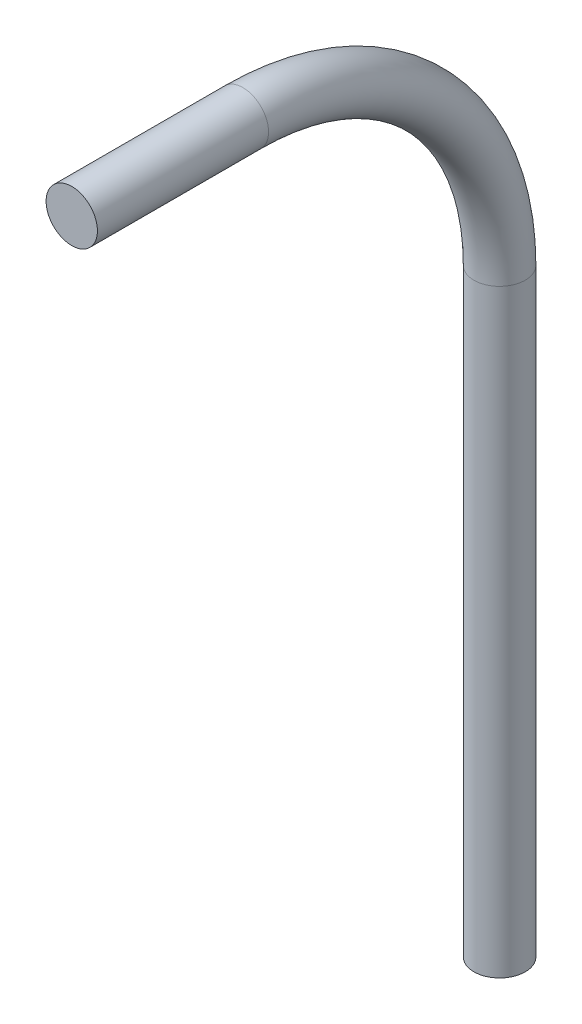
ISO-10303-21;
HEADER;
FILE_DESCRIPTION(('STEP AP214'),'2;1');
FILE_NAME('part.step','',(''),(''),'','','');
FILE_SCHEMA(('AUTOMOTIVE_DESIGN { 1 0 10303 214 1 1 1 1 }'));
ENDSEC;
DATA;
#1=APPLICATION_CONTEXT('core data for automotive mechanical design processes');
#2=APPLICATION_PROTOCOL_DEFINITION('international standard','automotive_design',2000,#1);
#3=PRODUCT_CONTEXT('',#1,'mechanical');
#4=PRODUCT('Part','Part','',(#3));
#5=PRODUCT_RELATED_PRODUCT_CATEGORY('part','',(#4));
#6=PRODUCT_DEFINITION_FORMATION('','',#4);
#7=PRODUCT_DEFINITION_CONTEXT('part definition',#1,'design');
#8=PRODUCT_DEFINITION('design','',#6,#7);
#9=PRODUCT_DEFINITION_SHAPE('','',#8);
#10=(LENGTH_UNIT() NAMED_UNIT(*) SI_UNIT(.MILLI.,.METRE.));
#11=(NAMED_UNIT(*) PLANE_ANGLE_UNIT() SI_UNIT($,.RADIAN.));
#12=(NAMED_UNIT(*) SI_UNIT($,.STERADIAN.) SOLID_ANGLE_UNIT());
#13=UNCERTAINTY_MEASURE_WITH_UNIT(LENGTH_MEASURE(1.E-05),#10,'distance_accuracy_value','');
#14=(GEOMETRIC_REPRESENTATION_CONTEXT(3) GLOBAL_UNCERTAINTY_ASSIGNED_CONTEXT((#13)) GLOBAL_UNIT_ASSIGNED_CONTEXT((#10,
#11,#12)) REPRESENTATION_CONTEXT('',''));
#15=CARTESIAN_POINT('',(0.,0.,0.));
#16=DIRECTION('',(0.,0.,1.));
#17=DIRECTION('',(1.,0.,0.));
#18=AXIS2_PLACEMENT_3D('',#15,#16,#17);
#19=CARTESIAN_POINT('',(-4.44089209850063E-13,-30.0000000000005,-49.9999999999999));
#20=DIRECTION('',(0.,-0.999999999999999,0.));
#21=DIRECTION('',(0.,0.,-0.999999999999999));
#22=AXIS2_PLACEMENT_3D('',#19,#20,#21);
#23=CYLINDRICAL_SURFACE('',#22,3.);
#24=CARTESIAN_POINT('',(-4.44089209850063E-13,-30.0000000000005,-49.9999999999999));
#25=DIRECTION('',(0.,0.999999999999999,0.));
#26=DIRECTION('',(1.,0.,0.));
#27=AXIS2_PLACEMENT_3D('',#24,#25,#26);
#28=CIRCLE('',#27,3.);
#29=CARTESIAN_POINT('',(-4.2188474935756E-13,-30.0000000000005,-52.9999999999999));
#30=VERTEX_POINT('',#29);
#31=EDGE_CURVE('E43',#30,#30,#28,.T.);
#32=ORIENTED_EDGE('',*,*,#31,.F.);
#33=EDGE_LOOP('',(#32));
#34=FACE_BOUND('',#33,.T.);
#35=CARTESIAN_POINT('',(-6.66133814775094E-13,-100.000000000001,-49.9999999999997));
#36=DIRECTION('',(0.,0.999999999999999,0.));
#37=DIRECTION('',(1.,0.,0.));
#38=AXIS2_PLACEMENT_3D('',#35,#36,#37);
#39=CIRCLE('',#38,3.);
#40=CARTESIAN_POINT('',(2.99999999999933,-100.000000000001,-49.9999999999997));
#41=VERTEX_POINT('',#40);
#42=EDGE_CURVE('E10',#41,#41,#39,.T.);
#43=ORIENTED_EDGE('',*,*,#42,.T.);
#44=EDGE_LOOP('',(#43));
#45=FACE_BOUND('',#44,.T.);
#46=ADVANCED_FACE('F37',(#34,#45),#23,.T.);
#47=CARTESIAN_POINT('',(-6.66133814775094E-13,-30.0000000000007,-19.9999999999999));
#48=DIRECTION('',(-1.,0.,0.));
#49=DIRECTION('',(0.,0.,0.999999999999999));
#50=AXIS2_PLACEMENT_3D('',#47,#48,#49);
#51=TOROIDAL_SURFACE('',#50,30.,3.);
#52=CARTESIAN_POINT('',(-1.11022302462516E-13,-4.44089209850063E-13,-19.9999999999999));
#53=DIRECTION('',(0.,0.,0.999999999999999));
#54=DIRECTION('',(1.,0.,0.));
#55=AXIS2_PLACEMENT_3D('',#52,#53,#54);
#56=CIRCLE('',#55,3.);
#57=CARTESIAN_POINT('',(0.,2.99999999999931,-19.9999999999999));
#58=VERTEX_POINT('',#57);
#59=EDGE_CURVE('E47',#58,#58,#56,.T.);
#60=CARTESIAN_POINT('',(-6.66133814775094E-13,-30.0000000000007,-19.9999999999999));
#61=DIRECTION('',(-1.,0.,0.));
#62=DIRECTION('',(0.,0.,0.999999999999999));
#63=AXIS2_PLACEMENT_3D('',#60,#61,#62);
#64=CIRCLE('',#63,33.);
#65=EDGE_CURVE('',#58,#30,#64,.T.);
#66=ORIENTED_EDGE('',*,*,#59,.F.);
#67=ORIENTED_EDGE('',*,*,#31,.T.);
#68=ORIENTED_EDGE('',*,*,#65,.T.);
#69=ORIENTED_EDGE('',*,*,#65,.F.);
#70=EDGE_LOOP('',(#66,#68,#67,#69));
#71=FACE_BOUND('',#70,.T.);
#72=ADVANCED_FACE('F62',(#71),#51,.T.);
#73=CARTESIAN_POINT('',(-1.11022302462516E-13,-4.44089209850063E-13,-19.9999999999999));
#74=DIRECTION('',(0.,0.,0.999999999999999));
#75=DIRECTION('',(1.,0.,0.));
#76=AXIS2_PLACEMENT_3D('',#73,#74,#75);
#77=CYLINDRICAL_SURFACE('',#76,3.);
#78=ORIENTED_EDGE('',*,*,#59,.T.);
#79=EDGE_LOOP('',(#78));
#80=FACE_BOUND('',#79,.T.);
#81=CARTESIAN_POINT('',(-3.33066907387547E-13,-4.44089209850063E-13,0.));
#82=DIRECTION('',(0.,0.,0.999999999999999));
#83=DIRECTION('',(1.,0.,0.));
#84=AXIS2_PLACEMENT_3D('',#81,#82,#83);
#85=CIRCLE('',#84,3.);
#86=CARTESIAN_POINT('',(2.99999999999967,-4.430900091279E-13,0.));
#87=VERTEX_POINT('',#86);
#88=EDGE_CURVE('E51',#87,#87,#85,.T.);
#89=ORIENTED_EDGE('',*,*,#88,.F.);
#90=EDGE_LOOP('',(#89));
#91=FACE_BOUND('',#90,.T.);
#92=ADVANCED_FACE('F59',(#80,#91),#77,.T.);
#93=CARTESIAN_POINT('',(-6.66133814775094E-13,-100.000000000001,-49.9999999999997));
#94=DIRECTION('',(0.,0.999999999999999,0.));
#95=DIRECTION('',(1.,0.,0.));
#96=AXIS2_PLACEMENT_3D('',#93,#94,#95);
#97=PLANE('',#96);
#98=ORIENTED_EDGE('',*,*,#42,.F.);
#99=EDGE_LOOP('',(#98));
#100=FACE_BOUND('',#99,.T.);
#101=ADVANCED_FACE('F61',(#100),#97,.F.);
#102=CARTESIAN_POINT('',(-3.33066907387547E-13,-4.44089209850063E-13,0.));
#103=DIRECTION('',(0.,0.,0.999999999999999));
#104=DIRECTION('',(1.,0.,0.));
#105=AXIS2_PLACEMENT_3D('',#102,#103,#104);
#106=PLANE('',#105);
#107=ORIENTED_EDGE('',*,*,#88,.T.);
#108=EDGE_LOOP('',(#107));
#109=FACE_BOUND('',#108,.T.);
#110=ADVANCED_FACE('F57',(#109),#106,.T.);
#111=CLOSED_SHELL('',(#46,#72,#92,#101,#110));
#112=MANIFOLD_SOLID_BREP('B2',#111);
#113=ADVANCED_BREP_SHAPE_REPRESENTATION('',(#18,#112),#14);
#114=SHAPE_DEFINITION_REPRESENTATION(#9,#113);
ENDSEC;
END-ISO-10303-21;
